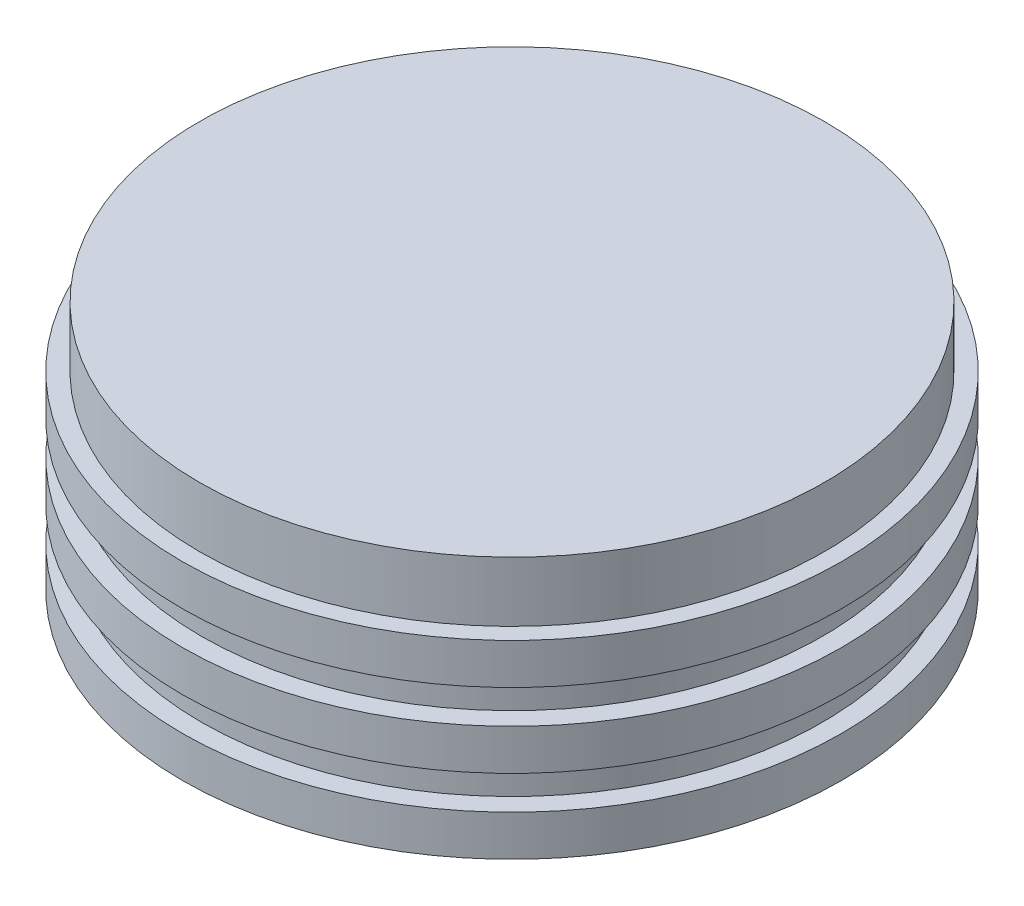
ISO-10303-21;
HEADER;
FILE_DESCRIPTION(('STEP AP214'),'2;1');
FILE_NAME('part.step','',(''),(''),'','','');
FILE_SCHEMA(('AUTOMOTIVE_DESIGN { 1 0 10303 214 1 1 1 1 }'));
ENDSEC;
DATA;
#1=APPLICATION_CONTEXT('core data for automotive mechanical design processes');
#2=APPLICATION_PROTOCOL_DEFINITION('international standard','automotive_design',2000,#1);
#3=PRODUCT_CONTEXT('',#1,'mechanical');
#4=PRODUCT('Part','Part','',(#3));
#5=PRODUCT_RELATED_PRODUCT_CATEGORY('part','',(#4));
#6=PRODUCT_DEFINITION_FORMATION('','',#4);
#7=PRODUCT_DEFINITION_CONTEXT('part definition',#1,'design');
#8=PRODUCT_DEFINITION('design','',#6,#7);
#9=PRODUCT_DEFINITION_SHAPE('','',#8);
#10=(LENGTH_UNIT() NAMED_UNIT(*) SI_UNIT(.MILLI.,.METRE.));
#11=(NAMED_UNIT(*) PLANE_ANGLE_UNIT() SI_UNIT($,.RADIAN.));
#12=(NAMED_UNIT(*) SI_UNIT($,.STERADIAN.) SOLID_ANGLE_UNIT());
#13=UNCERTAINTY_MEASURE_WITH_UNIT(LENGTH_MEASURE(1.E-05),#10,'distance_accuracy_value','');
#14=(GEOMETRIC_REPRESENTATION_CONTEXT(3) GLOBAL_UNCERTAINTY_ASSIGNED_CONTEXT((#13)) GLOBAL_UNIT_ASSIGNED_CONTEXT((#10,
#11,#12)) REPRESENTATION_CONTEXT('',''));
#15=CARTESIAN_POINT('',(0.,0.,0.));
#16=DIRECTION('',(0.,0.,1.));
#17=DIRECTION('',(1.,0.,0.));
#18=AXIS2_PLACEMENT_3D('',#15,#16,#17);
#19=CARTESIAN_POINT('',(-34.8996,0.,0.));
#20=DIRECTION('',(0.,1.,0.));
#21=DIRECTION('',(0.,0.,1.));
#22=AXIS2_PLACEMENT_3D('',#19,#20,#21);
#23=PLANE('',#22);
#24=CARTESIAN_POINT('',(0.,0.,0.));
#25=DIRECTION('',(0.,-1.,0.));
#26=DIRECTION('',(0.,0.,-1.));
#27=AXIS2_PLACEMENT_3D('',#24,#25,#26);
#28=CIRCLE('',#27,3.96875);
#29=CARTESIAN_POINT('',(0.,0.,-3.96875));
#30=VERTEX_POINT('',#29);
#31=EDGE_CURVE('E63',#30,#30,#28,.T.);
#32=ORIENTED_EDGE('',*,*,#31,.F.);
#33=EDGE_LOOP('',(#32));
#34=FACE_BOUND('',#33,.T.);
#35=CARTESIAN_POINT('',(0.,0.,0.));
#36=DIRECTION('',(0.,-1.,0.));
#37=DIRECTION('',(0.,0.,-1.));
#38=AXIS2_PLACEMENT_3D('',#35,#36,#37);
#39=CIRCLE('',#38,34.8996);
#40=CARTESIAN_POINT('',(0.,0.,-34.8996));
#41=VERTEX_POINT('',#40);
#42=EDGE_CURVE('E62',#41,#41,#39,.T.);
#43=ORIENTED_EDGE('',*,*,#42,.T.);
#44=EDGE_LOOP('',(#43));
#45=FACE_BOUND('',#44,.T.);
#46=ADVANCED_FACE('F43',(#34,#45),#23,.F.);
#47=CARTESIAN_POINT('',(0.,26.416,0.));
#48=DIRECTION('',(0.,-1.,0.));
#49=DIRECTION('',(0.,0.,-1.));
#50=AXIS2_PLACEMENT_3D('',#47,#48,#49);
#51=PLANE('',#50);
#52=CARTESIAN_POINT('',(0.,26.416,0.));
#53=DIRECTION('',(0.,-1.,0.));
#54=DIRECTION('',(0.,0.,-1.));
#55=AXIS2_PLACEMENT_3D('',#52,#53,#54);
#56=CIRCLE('',#55,33.0835);
#57=CARTESIAN_POINT('',(0.,26.416,-33.0835));
#58=VERTEX_POINT('',#57);
#59=EDGE_CURVE('E11',#58,#58,#56,.T.);
#60=ORIENTED_EDGE('',*,*,#59,.F.);
#61=EDGE_LOOP('',(#60));
#62=FACE_BOUND('',#61,.T.);
#63=ADVANCED_FACE('F104',(#62),#51,.F.);
#64=CARTESIAN_POINT('',(0.,0.,0.));
#65=DIRECTION('',(0.,-1.,0.));
#66=DIRECTION('',(0.,0.,-1.));
#67=AXIS2_PLACEMENT_3D('',#64,#65,#66);
#68=CYLINDRICAL_SURFACE('',#67,33.0835);
#69=CARTESIAN_POINT('',(0.,20.066,0.));
#70=DIRECTION('',(0.,-1.,0.));
#71=DIRECTION('',(0.,0.,-1.));
#72=AXIS2_PLACEMENT_3D('',#69,#70,#71);
#73=CIRCLE('',#72,33.0835);
#74=CARTESIAN_POINT('',(0.,20.066,-33.0835));
#75=VERTEX_POINT('',#74);
#76=EDGE_CURVE('E49',#75,#75,#73,.T.);
#77=ORIENTED_EDGE('',*,*,#76,.F.);
#78=EDGE_LOOP('',(#77));
#79=FACE_BOUND('',#78,.T.);
#80=ORIENTED_EDGE('',*,*,#59,.T.);
#81=EDGE_LOOP('',(#80));
#82=FACE_BOUND('',#81,.T.);
#83=ADVANCED_FACE('F101',(#79,#82),#68,.T.);
#84=CARTESIAN_POINT('',(-33.0835,20.066,0.));
#85=DIRECTION('',(0.,-1.,0.));
#86=DIRECTION('',(0.,0.,-1.));
#87=AXIS2_PLACEMENT_3D('',#84,#85,#86);
#88=PLANE('',#87);
#89=CARTESIAN_POINT('',(0.,20.066,0.));
#90=DIRECTION('',(0.,-1.,0.));
#91=DIRECTION('',(0.,0.,-1.));
#92=AXIS2_PLACEMENT_3D('',#89,#90,#91);
#93=CIRCLE('',#92,34.8996);
#94=CARTESIAN_POINT('',(0.,20.066,-34.8996));
#95=VERTEX_POINT('',#94);
#96=EDGE_CURVE('E94',#95,#95,#93,.T.);
#97=ORIENTED_EDGE('',*,*,#96,.F.);
#98=EDGE_LOOP('',(#97));
#99=FACE_BOUND('',#98,.T.);
#100=ORIENTED_EDGE('',*,*,#76,.T.);
#101=EDGE_LOOP('',(#100));
#102=FACE_BOUND('',#101,.T.);
#103=ADVANCED_FACE('F99',(#99,#102),#88,.F.);
#104=CARTESIAN_POINT('',(0.,0.,0.));
#105=DIRECTION('',(0.,-1.,0.));
#106=DIRECTION('',(0.,0.,-1.));
#107=AXIS2_PLACEMENT_3D('',#104,#105,#106);
#108=CYLINDRICAL_SURFACE('',#107,34.8996);
#109=CARTESIAN_POINT('',(0.,15.748,0.));
#110=DIRECTION('',(0.,-1.,0.));
#111=DIRECTION('',(0.,0.,-1.));
#112=AXIS2_PLACEMENT_3D('',#109,#110,#111);
#113=CIRCLE('',#112,34.8996);
#114=CARTESIAN_POINT('',(0.,15.748,-34.8996));
#115=VERTEX_POINT('',#114);
#116=EDGE_CURVE('E91',#115,#115,#113,.T.);
#117=ORIENTED_EDGE('',*,*,#116,.F.);
#118=EDGE_LOOP('',(#117));
#119=FACE_BOUND('',#118,.T.);
#120=ORIENTED_EDGE('',*,*,#96,.T.);
#121=EDGE_LOOP('',(#120));
#122=FACE_BOUND('',#121,.T.);
#123=ADVANCED_FACE('F116',(#119,#122),#108,.T.);
#124=CARTESIAN_POINT('',(-34.8996,15.748,0.));
#125=DIRECTION('',(0.,1.,0.));
#126=DIRECTION('',(0.,0.,1.));
#127=AXIS2_PLACEMENT_3D('',#124,#125,#126);
#128=PLANE('',#127);
#129=CARTESIAN_POINT('',(0.,15.748,0.));
#130=DIRECTION('',(0.,-1.,0.));
#131=DIRECTION('',(0.,0.,-1.));
#132=AXIS2_PLACEMENT_3D('',#129,#130,#131);
#133=CIRCLE('',#132,32.8676);
#134=CARTESIAN_POINT('',(0.,15.748,-32.8676));
#135=VERTEX_POINT('',#134);
#136=EDGE_CURVE('E88',#135,#135,#133,.T.);
#137=ORIENTED_EDGE('',*,*,#136,.F.);
#138=EDGE_LOOP('',(#137));
#139=FACE_BOUND('',#138,.T.);
#140=ORIENTED_EDGE('',*,*,#116,.T.);
#141=EDGE_LOOP('',(#140));
#142=FACE_BOUND('',#141,.T.);
#143=ADVANCED_FACE('F120',(#139,#142),#128,.F.);
#144=CARTESIAN_POINT('',(0.,0.,0.));
#145=DIRECTION('',(0.,-1.,0.));
#146=DIRECTION('',(0.,0.,-1.));
#147=AXIS2_PLACEMENT_3D('',#144,#145,#146);
#148=CYLINDRICAL_SURFACE('',#147,32.8676);
#149=CARTESIAN_POINT('',(0.,12.192,0.));
#150=DIRECTION('',(0.,-1.,0.));
#151=DIRECTION('',(0.,0.,-1.));
#152=AXIS2_PLACEMENT_3D('',#149,#150,#151);
#153=CIRCLE('',#152,32.8676);
#154=CARTESIAN_POINT('',(0.,12.192,-32.8676));
#155=VERTEX_POINT('',#154);
#156=EDGE_CURVE('E85',#155,#155,#153,.T.);
#157=ORIENTED_EDGE('',*,*,#156,.F.);
#158=EDGE_LOOP('',(#157));
#159=FACE_BOUND('',#158,.T.);
#160=ORIENTED_EDGE('',*,*,#136,.T.);
#161=EDGE_LOOP('',(#160));
#162=FACE_BOUND('',#161,.T.);
#163=ADVANCED_FACE('F124',(#159,#162),#148,.T.);
#164=CARTESIAN_POINT('',(-34.8996,12.192,0.));
#165=DIRECTION('',(0.,-1.,0.));
#166=DIRECTION('',(0.,0.,-1.));
#167=AXIS2_PLACEMENT_3D('',#164,#165,#166);
#168=PLANE('',#167);
#169=CARTESIAN_POINT('',(0.,12.192,0.));
#170=DIRECTION('',(0.,-1.,0.));
#171=DIRECTION('',(0.,0.,-1.));
#172=AXIS2_PLACEMENT_3D('',#169,#170,#171);
#173=CIRCLE('',#172,34.8996);
#174=CARTESIAN_POINT('',(0.,12.192,-34.8996));
#175=VERTEX_POINT('',#174);
#176=EDGE_CURVE('E82',#175,#175,#173,.T.);
#177=ORIENTED_EDGE('',*,*,#176,.F.);
#178=EDGE_LOOP('',(#177));
#179=FACE_BOUND('',#178,.T.);
#180=ORIENTED_EDGE('',*,*,#156,.T.);
#181=EDGE_LOOP('',(#180));
#182=FACE_BOUND('',#181,.T.);
#183=ADVANCED_FACE('F128',(#179,#182),#168,.F.);
#184=CARTESIAN_POINT('',(0.,0.,0.));
#185=DIRECTION('',(0.,-1.,0.));
#186=DIRECTION('',(0.,0.,-1.));
#187=AXIS2_PLACEMENT_3D('',#184,#185,#186);
#188=CYLINDRICAL_SURFACE('',#187,34.8996);
#189=CARTESIAN_POINT('',(0.,7.874,0.));
#190=DIRECTION('',(0.,-1.,0.));
#191=DIRECTION('',(0.,0.,-1.));
#192=AXIS2_PLACEMENT_3D('',#189,#190,#191);
#193=CIRCLE('',#192,34.8996);
#194=CARTESIAN_POINT('',(0.,7.874,-34.8996));
#195=VERTEX_POINT('',#194);
#196=EDGE_CURVE('E79',#195,#195,#193,.T.);
#197=ORIENTED_EDGE('',*,*,#196,.F.);
#198=EDGE_LOOP('',(#197));
#199=FACE_BOUND('',#198,.T.);
#200=ORIENTED_EDGE('',*,*,#176,.T.);
#201=EDGE_LOOP('',(#200));
#202=FACE_BOUND('',#201,.T.);
#203=ADVANCED_FACE('F132',(#199,#202),#188,.T.);
#204=CARTESIAN_POINT('',(-32.8676,7.874,0.));
#205=DIRECTION('',(0.,1.,0.));
#206=DIRECTION('',(0.,0.,1.));
#207=AXIS2_PLACEMENT_3D('',#204,#205,#206);
#208=PLANE('',#207);
#209=CARTESIAN_POINT('',(0.,7.874,0.));
#210=DIRECTION('',(0.,-1.,0.));
#211=DIRECTION('',(0.,0.,-1.));
#212=AXIS2_PLACEMENT_3D('',#209,#210,#211);
#213=CIRCLE('',#212,32.8676);
#214=CARTESIAN_POINT('',(0.,7.874,-32.8676));
#215=VERTEX_POINT('',#214);
#216=EDGE_CURVE('E76',#215,#215,#213,.T.);
#217=ORIENTED_EDGE('',*,*,#216,.F.);
#218=EDGE_LOOP('',(#217));
#219=FACE_BOUND('',#218,.T.);
#220=ORIENTED_EDGE('',*,*,#196,.T.);
#221=EDGE_LOOP('',(#220));
#222=FACE_BOUND('',#221,.T.);
#223=ADVANCED_FACE('F136',(#219,#222),#208,.F.);
#224=CARTESIAN_POINT('',(0.,0.,0.));
#225=DIRECTION('',(0.,-1.,0.));
#226=DIRECTION('',(0.,0.,-1.));
#227=AXIS2_PLACEMENT_3D('',#224,#225,#226);
#228=CYLINDRICAL_SURFACE('',#227,32.8676);
#229=CARTESIAN_POINT('',(0.,4.318,0.));
#230=DIRECTION('',(0.,-1.,0.));
#231=DIRECTION('',(0.,0.,-1.));
#232=AXIS2_PLACEMENT_3D('',#229,#230,#231);
#233=CIRCLE('',#232,32.8676);
#234=CARTESIAN_POINT('',(0.,4.318,-32.8676));
#235=VERTEX_POINT('',#234);
#236=EDGE_CURVE('E73',#235,#235,#233,.T.);
#237=ORIENTED_EDGE('',*,*,#236,.F.);
#238=EDGE_LOOP('',(#237));
#239=FACE_BOUND('',#238,.T.);
#240=ORIENTED_EDGE('',*,*,#216,.T.);
#241=EDGE_LOOP('',(#240));
#242=FACE_BOUND('',#241,.T.);
#243=ADVANCED_FACE('F140',(#239,#242),#228,.T.);
#244=CARTESIAN_POINT('',(-32.8676,4.318,0.));
#245=DIRECTION('',(0.,-1.,0.));
#246=DIRECTION('',(0.,0.,-1.));
#247=AXIS2_PLACEMENT_3D('',#244,#245,#246);
#248=PLANE('',#247);
#249=CARTESIAN_POINT('',(0.,4.318,0.));
#250=DIRECTION('',(0.,-1.,0.));
#251=DIRECTION('',(0.,0.,-1.));
#252=AXIS2_PLACEMENT_3D('',#249,#250,#251);
#253=CIRCLE('',#252,34.8996);
#254=CARTESIAN_POINT('',(0.,4.318,-34.8996));
#255=VERTEX_POINT('',#254);
#256=EDGE_CURVE('E66',#255,#255,#253,.T.);
#257=ORIENTED_EDGE('',*,*,#256,.F.);
#258=EDGE_LOOP('',(#257));
#259=FACE_BOUND('',#258,.T.);
#260=ORIENTED_EDGE('',*,*,#236,.T.);
#261=EDGE_LOOP('',(#260));
#262=FACE_BOUND('',#261,.T.);
#263=ADVANCED_FACE('F144',(#259,#262),#248,.F.);
#264=CARTESIAN_POINT('',(0.,0.,0.));
#265=DIRECTION('',(0.,-1.,0.));
#266=DIRECTION('',(0.,0.,-1.));
#267=AXIS2_PLACEMENT_3D('',#264,#265,#266);
#268=CYLINDRICAL_SURFACE('',#267,34.8996);
#269=ORIENTED_EDGE('',*,*,#42,.F.);
#270=EDGE_LOOP('',(#269));
#271=FACE_BOUND('',#270,.T.);
#272=ORIENTED_EDGE('',*,*,#256,.T.);
#273=EDGE_LOOP('',(#272));
#274=FACE_BOUND('',#273,.T.);
#275=ADVANCED_FACE('F56',(#271,#274),#268,.T.);
#276=CARTESIAN_POINT('',(0.,15.875,0.));
#277=DIRECTION('',(0.,-1.,0.));
#278=DIRECTION('',(0.,0.,-1.));
#279=AXIS2_PLACEMENT_3D('',#276,#277,#278);
#280=CONICAL_SURFACE('',#279,3.96875,1.02974425867665);
#281=CARTESIAN_POINT('',(0.,18.2596655817656,0.));
#282=VERTEX_POINT('',#281);
#283=VERTEX_LOOP('',#282);
#284=FACE_BOUND('',#283,.T.);
#285=CARTESIAN_POINT('',(0.,15.875,0.));
#286=DIRECTION('',(0.,-1.,0.));
#287=DIRECTION('',(0.,0.,-1.));
#288=AXIS2_PLACEMENT_3D('',#285,#286,#287);
#289=CIRCLE('',#288,3.96875);
#290=CARTESIAN_POINT('',(0.,15.875,-3.96875));
#291=VERTEX_POINT('',#290);
#292=EDGE_CURVE('E60',#291,#291,#289,.T.);
#293=ORIENTED_EDGE('',*,*,#292,.T.);
#294=EDGE_LOOP('',(#293));
#295=FACE_BOUND('',#294,.T.);
#296=ADVANCED_FACE('F52',(#284,#295),#280,.F.);
#297=CARTESIAN_POINT('',(0.,0.,0.));
#298=DIRECTION('',(0.,-1.,0.));
#299=DIRECTION('',(0.,0.,-1.));
#300=AXIS2_PLACEMENT_3D('',#297,#298,#299);
#301=CYLINDRICAL_SURFACE('',#300,3.96875);
#302=ORIENTED_EDGE('',*,*,#292,.F.);
#303=EDGE_LOOP('',(#302));
#304=FACE_BOUND('',#303,.T.);
#305=ORIENTED_EDGE('',*,*,#31,.T.);
#306=EDGE_LOOP('',(#305));
#307=FACE_BOUND('',#306,.T.);
#308=ADVANCED_FACE('F55',(#304,#307),#301,.F.);
#309=CLOSED_SHELL('',(#46,#63,#83,#103,#123,#143,#163,#183,#203,#223,#243,#263,#275,#296,#308));
#310=MANIFOLD_SOLID_BREP('B2',#309);
#311=ADVANCED_BREP_SHAPE_REPRESENTATION('',(#18,#310),#14);
#312=SHAPE_DEFINITION_REPRESENTATION(#9,#311);
ENDSEC;
END-ISO-10303-21;
